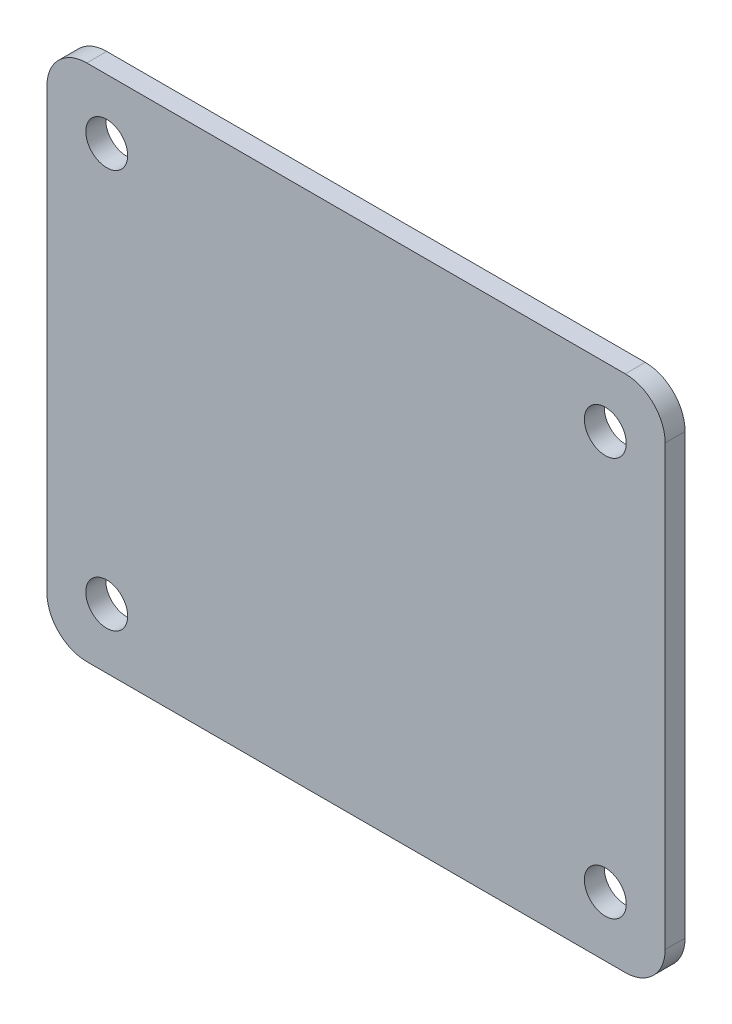
ISO-10303-21;
HEADER;
FILE_DESCRIPTION(('STEP AP214'),'2;1');
FILE_NAME('part.step','',(''),(''),'','','');
FILE_SCHEMA(('AUTOMOTIVE_DESIGN { 1 0 10303 214 1 1 1 1 }'));
ENDSEC;
DATA;
#1=APPLICATION_CONTEXT('core data for automotive mechanical design processes');
#2=APPLICATION_PROTOCOL_DEFINITION('international standard','automotive_design',2000,#1);
#3=PRODUCT_CONTEXT('',#1,'mechanical');
#4=PRODUCT('Part','Part','',(#3));
#5=PRODUCT_RELATED_PRODUCT_CATEGORY('part','',(#4));
#6=PRODUCT_DEFINITION_FORMATION('','',#4);
#7=PRODUCT_DEFINITION_CONTEXT('part definition',#1,'design');
#8=PRODUCT_DEFINITION('design','',#6,#7);
#9=PRODUCT_DEFINITION_SHAPE('','',#8);
#10=(LENGTH_UNIT() NAMED_UNIT(*) SI_UNIT(.MILLI.,.METRE.));
#11=(NAMED_UNIT(*) PLANE_ANGLE_UNIT() SI_UNIT($,.RADIAN.));
#12=(NAMED_UNIT(*) SI_UNIT($,.STERADIAN.) SOLID_ANGLE_UNIT());
#13=UNCERTAINTY_MEASURE_WITH_UNIT(LENGTH_MEASURE(1.E-05),#10,'distance_accuracy_value','');
#14=(GEOMETRIC_REPRESENTATION_CONTEXT(3) GLOBAL_UNCERTAINTY_ASSIGNED_CONTEXT((#13)) GLOBAL_UNIT_ASSIGNED_CONTEXT((#10,
#11,#12)) REPRESENTATION_CONTEXT('',''));
#15=CARTESIAN_POINT('',(0.,0.,0.));
#16=DIRECTION('',(0.,0.,1.));
#17=DIRECTION('',(1.,0.,0.));
#18=AXIS2_PLACEMENT_3D('',#15,#16,#17);
#19=CARTESIAN_POINT('',(-67.5,20.25,50.));
#20=DIRECTION('',(0.,0.,-1.));
#21=DIRECTION('',(-1.,0.,0.));
#22=AXIS2_PLACEMENT_3D('',#19,#20,#21);
#23=PLANE('',#22);
#24=CARTESIAN_POINT('',(-67.5,20.25,50.));
#25=DIRECTION('',(0.,0.,1.));
#26=DIRECTION('',(-1.,0.,0.));
#27=AXIS2_PLACEMENT_3D('',#24,#25,#26);
#28=CIRCLE('',#27,10.);
#29=CARTESIAN_POINT('',(-77.5,20.25,50.));
#30=VERTEX_POINT('',#29);
#31=CARTESIAN_POINT('',(-67.5,10.25,50.));
#32=VERTEX_POINT('',#31);
#33=EDGE_CURVE('E166',#30,#32,#28,.T.);
#34=ORIENTED_EDGE('',*,*,#33,.T.);
#35=DIRECTION('',(1.,0.,0.));
#36=VECTOR('',#35,1.);
#37=CARTESIAN_POINT('',(-67.5,10.25,50.));
#38=LINE('',#37,#36);
#39=CARTESIAN_POINT('',(67.5,10.25,50.));
#40=VERTEX_POINT('',#39);
#41=EDGE_CURVE('E101',#32,#40,#38,.T.);
#42=ORIENTED_EDGE('',*,*,#41,.T.);
#43=CARTESIAN_POINT('',(67.5,20.25,50.));
#44=DIRECTION('',(0.,0.,1.));
#45=DIRECTION('',(1.,0.,0.));
#46=AXIS2_PLACEMENT_3D('',#43,#44,#45);
#47=CIRCLE('',#46,10.);
#48=CARTESIAN_POINT('',(77.5,20.25,50.));
#49=VERTEX_POINT('',#48);
#50=EDGE_CURVE('E189',#40,#49,#47,.T.);
#51=ORIENTED_EDGE('',*,*,#50,.T.);
#52=DIRECTION('',(0.,1.,0.));
#53=VECTOR('',#52,1.);
#54=CARTESIAN_POINT('',(77.5,20.25,50.));
#55=LINE('',#54,#53);
#56=CARTESIAN_POINT('',(77.5,130.25,50.));
#57=VERTEX_POINT('',#56);
#58=EDGE_CURVE('E202',#49,#57,#55,.T.);
#59=ORIENTED_EDGE('',*,*,#58,.T.);
#60=CARTESIAN_POINT('',(67.5,130.25,50.));
#61=DIRECTION('',(0.,0.,1.));
#62=DIRECTION('',(-1.,0.,0.));
#63=AXIS2_PLACEMENT_3D('',#60,#61,#62);
#64=CIRCLE('',#63,9.99999999999999);
#65=CARTESIAN_POINT('',(67.5,140.25,50.));
#66=VERTEX_POINT('',#65);
#67=EDGE_CURVE('E120',#57,#66,#64,.T.);
#68=ORIENTED_EDGE('',*,*,#67,.T.);
#69=DIRECTION('',(-1.,0.,0.));
#70=VECTOR('',#69,1.);
#71=CARTESIAN_POINT('',(-67.5,140.25,50.));
#72=LINE('',#71,#70);
#73=CARTESIAN_POINT('',(-67.5,140.25,50.));
#74=VERTEX_POINT('',#73);
#75=EDGE_CURVE('E114',#66,#74,#72,.T.);
#76=ORIENTED_EDGE('',*,*,#75,.T.);
#77=CARTESIAN_POINT('',(-67.5,130.25,50.));
#78=DIRECTION('',(0.,0.,1.));
#79=DIRECTION('',(-1.,0.,0.));
#80=AXIS2_PLACEMENT_3D('',#77,#78,#79);
#81=CIRCLE('',#80,10.);
#82=CARTESIAN_POINT('',(-77.5,130.25,50.));
#83=VERTEX_POINT('',#82);
#84=EDGE_CURVE('E118',#74,#83,#81,.T.);
#85=ORIENTED_EDGE('',*,*,#84,.T.);
#86=DIRECTION('',(0.,-1.,0.));
#87=VECTOR('',#86,1.);
#88=CARTESIAN_POINT('',(-77.5,20.25,50.));
#89=LINE('',#88,#87);
#90=EDGE_CURVE('E58',#83,#30,#89,.T.);
#91=ORIENTED_EDGE('',*,*,#90,.T.);
#92=EDGE_LOOP('',(#34,#42,#51,#59,#68,#76,#85,#91));
#93=FACE_BOUND('',#92,.T.);
#94=CARTESIAN_POINT('',(62.5,125.25,50.));
#95=DIRECTION('',(0.,0.,1.));
#96=DIRECTION('',(1.,0.,0.));
#97=AXIS2_PLACEMENT_3D('',#94,#95,#96);
#98=CIRCLE('',#97,5.25000000000002);
#99=CARTESIAN_POINT('',(67.75,125.25,50.));
#100=VERTEX_POINT('',#99);
#101=EDGE_CURVE('E148',#100,#100,#98,.T.);
#102=ORIENTED_EDGE('',*,*,#101,.F.);
#103=EDGE_LOOP('',(#102));
#104=FACE_BOUND('',#103,.T.);
#105=CARTESIAN_POINT('',(62.5,25.25,50.));
#106=DIRECTION('',(0.,0.,1.));
#107=DIRECTION('',(1.,0.,0.));
#108=AXIS2_PLACEMENT_3D('',#105,#106,#107);
#109=CIRCLE('',#108,5.24999999999998);
#110=CARTESIAN_POINT('',(67.75,25.25,50.));
#111=VERTEX_POINT('',#110);
#112=EDGE_CURVE('E217',#111,#111,#109,.T.);
#113=ORIENTED_EDGE('',*,*,#112,.F.);
#114=EDGE_LOOP('',(#113));
#115=FACE_BOUND('',#114,.T.);
#116=CARTESIAN_POINT('',(-62.5,25.25,50.));
#117=DIRECTION('',(0.,0.,1.));
#118=DIRECTION('',(1.,0.,0.));
#119=AXIS2_PLACEMENT_3D('',#116,#117,#118);
#120=CIRCLE('',#119,5.25);
#121=CARTESIAN_POINT('',(-57.25,25.25,50.));
#122=VERTEX_POINT('',#121);
#123=EDGE_CURVE('E225',#122,#122,#120,.T.);
#124=ORIENTED_EDGE('',*,*,#123,.F.);
#125=EDGE_LOOP('',(#124));
#126=FACE_BOUND('',#125,.T.);
#127=CARTESIAN_POINT('',(-62.5,125.25,50.));
#128=DIRECTION('',(0.,0.,1.));
#129=DIRECTION('',(1.,0.,0.));
#130=AXIS2_PLACEMENT_3D('',#127,#128,#129);
#131=CIRCLE('',#130,5.25);
#132=CARTESIAN_POINT('',(-57.25,125.25,50.));
#133=VERTEX_POINT('',#132);
#134=EDGE_CURVE('E233',#133,#133,#131,.T.);
#135=ORIENTED_EDGE('',*,*,#134,.F.);
#136=EDGE_LOOP('',(#135));
#137=FACE_BOUND('',#136,.T.);
#138=ADVANCED_FACE('F40',(#93,#104,#115,#126,#137),#23,.F.);
#139=CARTESIAN_POINT('',(-67.5,20.25,45.));
#140=DIRECTION('',(0.,0.,-1.));
#141=DIRECTION('',(-1.,0.,0.));
#142=AXIS2_PLACEMENT_3D('',#139,#140,#141);
#143=PLANE('',#142);
#144=CARTESIAN_POINT('',(-62.5,25.25,45.));
#145=DIRECTION('',(0.,0.,1.));
#146=DIRECTION('',(1.,0.,0.));
#147=AXIS2_PLACEMENT_3D('',#144,#145,#146);
#148=CIRCLE('',#147,5.25);
#149=CARTESIAN_POINT('',(-57.25,25.25,45.));
#150=VERTEX_POINT('',#149);
#151=EDGE_CURVE('E229',#150,#150,#148,.T.);
#152=ORIENTED_EDGE('',*,*,#151,.T.);
#153=EDGE_LOOP('',(#152));
#154=FACE_BOUND('',#153,.T.);
#155=CARTESIAN_POINT('',(62.5,125.25,45.));
#156=DIRECTION('',(0.,0.,1.));
#157=DIRECTION('',(1.,0.,0.));
#158=AXIS2_PLACEMENT_3D('',#155,#156,#157);
#159=CIRCLE('',#158,5.25000000000002);
#160=CARTESIAN_POINT('',(67.75,125.25,45.));
#161=VERTEX_POINT('',#160);
#162=EDGE_CURVE('E213',#161,#161,#159,.T.);
#163=ORIENTED_EDGE('',*,*,#162,.T.);
#164=EDGE_LOOP('',(#163));
#165=FACE_BOUND('',#164,.T.);
#166=CARTESIAN_POINT('',(-67.5,20.25,45.));
#167=DIRECTION('',(0.,0.,1.));
#168=DIRECTION('',(-1.,0.,0.));
#169=AXIS2_PLACEMENT_3D('',#166,#167,#168);
#170=CIRCLE('',#169,10.);
#171=CARTESIAN_POINT('',(-77.5,20.25,45.));
#172=VERTEX_POINT('',#171);
#173=CARTESIAN_POINT('',(-67.5,10.25,45.));
#174=VERTEX_POINT('',#173);
#175=EDGE_CURVE('E143',#172,#174,#170,.T.);
#176=ORIENTED_EDGE('',*,*,#175,.F.);
#177=DIRECTION('',(0.,-1.,0.));
#178=VECTOR('',#177,1.);
#179=CARTESIAN_POINT('',(-77.5,20.25,45.));
#180=LINE('',#179,#178);
#181=CARTESIAN_POINT('',(-77.5,130.25,45.));
#182=VERTEX_POINT('',#181);
#183=EDGE_CURVE('E93',#182,#172,#180,.T.);
#184=ORIENTED_EDGE('',*,*,#183,.F.);
#185=CARTESIAN_POINT('',(-67.5,130.25,45.));
#186=DIRECTION('',(0.,0.,1.));
#187=DIRECTION('',(-1.,0.,0.));
#188=AXIS2_PLACEMENT_3D('',#185,#186,#187);
#189=CIRCLE('',#188,10.);
#190=CARTESIAN_POINT('',(-67.5,140.25,45.));
#191=VERTEX_POINT('',#190);
#192=EDGE_CURVE('E87',#191,#182,#189,.T.);
#193=ORIENTED_EDGE('',*,*,#192,.F.);
#194=DIRECTION('',(-1.,0.,0.));
#195=VECTOR('',#194,1.);
#196=CARTESIAN_POINT('',(-67.5,140.25,45.));
#197=LINE('',#196,#195);
#198=CARTESIAN_POINT('',(67.5,140.25,45.));
#199=VERTEX_POINT('',#198);
#200=EDGE_CURVE('E129',#199,#191,#197,.T.);
#201=ORIENTED_EDGE('',*,*,#200,.F.);
#202=CARTESIAN_POINT('',(67.5,130.25,45.));
#203=DIRECTION('',(0.,0.,1.));
#204=DIRECTION('',(-1.,0.,0.));
#205=AXIS2_PLACEMENT_3D('',#202,#203,#204);
#206=CIRCLE('',#205,9.99999999999999);
#207=CARTESIAN_POINT('',(77.5,130.25,45.));
#208=VERTEX_POINT('',#207);
#209=EDGE_CURVE('E157',#208,#199,#206,.T.);
#210=ORIENTED_EDGE('',*,*,#209,.F.);
#211=DIRECTION('',(0.,1.,0.));
#212=VECTOR('',#211,1.);
#213=CARTESIAN_POINT('',(77.5,20.25,45.));
#214=LINE('',#213,#212);
#215=CARTESIAN_POINT('',(77.5,20.25,45.));
#216=VERTEX_POINT('',#215);
#217=EDGE_CURVE('E154',#216,#208,#214,.T.);
#218=ORIENTED_EDGE('',*,*,#217,.F.);
#219=CARTESIAN_POINT('',(67.5,20.25,45.));
#220=DIRECTION('',(0.,0.,1.));
#221=DIRECTION('',(1.,0.,0.));
#222=AXIS2_PLACEMENT_3D('',#219,#220,#221);
#223=CIRCLE('',#222,10.);
#224=CARTESIAN_POINT('',(67.5,10.25,45.));
#225=VERTEX_POINT('',#224);
#226=EDGE_CURVE('E151',#225,#216,#223,.T.);
#227=ORIENTED_EDGE('',*,*,#226,.F.);
#228=DIRECTION('',(1.,0.,0.));
#229=VECTOR('',#228,1.);
#230=CARTESIAN_POINT('',(-67.5,10.25,45.));
#231=LINE('',#230,#229);
#232=EDGE_CURVE('E147',#174,#225,#231,.T.);
#233=ORIENTED_EDGE('',*,*,#232,.F.);
#234=EDGE_LOOP('',(#176,#184,#193,#201,#210,#218,#227,#233));
#235=FACE_BOUND('',#234,.T.);
#236=CARTESIAN_POINT('',(62.5,25.25,45.));
#237=DIRECTION('',(0.,0.,1.));
#238=DIRECTION('',(1.,0.,0.));
#239=AXIS2_PLACEMENT_3D('',#236,#237,#238);
#240=CIRCLE('',#239,5.24999999999998);
#241=CARTESIAN_POINT('',(67.75,25.25,45.));
#242=VERTEX_POINT('',#241);
#243=EDGE_CURVE('E221',#242,#242,#240,.T.);
#244=ORIENTED_EDGE('',*,*,#243,.T.);
#245=EDGE_LOOP('',(#244));
#246=FACE_BOUND('',#245,.T.);
#247=CARTESIAN_POINT('',(-62.5,125.25,45.));
#248=DIRECTION('',(0.,0.,1.));
#249=DIRECTION('',(1.,0.,0.));
#250=AXIS2_PLACEMENT_3D('',#247,#248,#249);
#251=CIRCLE('',#250,5.25);
#252=CARTESIAN_POINT('',(-57.25,125.25,45.));
#253=VERTEX_POINT('',#252);
#254=EDGE_CURVE('E237',#253,#253,#251,.T.);
#255=ORIENTED_EDGE('',*,*,#254,.T.);
#256=EDGE_LOOP('',(#255));
#257=FACE_BOUND('',#256,.T.);
#258=ADVANCED_FACE('F193',(#154,#165,#235,#246,#257),#143,.T.);
#259=CARTESIAN_POINT('',(-67.5,20.25,50.));
#260=DIRECTION('',(0.,0.,-1.));
#261=DIRECTION('',(-1.,0.,0.));
#262=AXIS2_PLACEMENT_3D('',#259,#260,#261);
#263=CYLINDRICAL_SURFACE('',#262,10.);
#264=ORIENTED_EDGE('',*,*,#175,.T.);
#265=DIRECTION('',(0.,0.,-1.));
#266=VECTOR('',#265,1.);
#267=CARTESIAN_POINT('',(-67.5,10.25,50.));
#268=LINE('',#267,#266);
#269=EDGE_CURVE('E11',#32,#174,#268,.T.);
#270=ORIENTED_EDGE('',*,*,#269,.F.);
#271=ORIENTED_EDGE('',*,*,#33,.F.);
#272=DIRECTION('',(0.,0.,-1.));
#273=VECTOR('',#272,1.);
#274=CARTESIAN_POINT('',(-77.5,20.25,50.));
#275=LINE('',#274,#273);
#276=EDGE_CURVE('E139',#30,#172,#275,.T.);
#277=ORIENTED_EDGE('',*,*,#276,.T.);
#278=EDGE_LOOP('',(#264,#270,#271,#277));
#279=FACE_BOUND('',#278,.T.);
#280=ADVANCED_FACE('F42',(#279),#263,.T.);
#281=CARTESIAN_POINT('',(-67.5,10.25,50.));
#282=DIRECTION('',(0.,1.,0.));
#283=DIRECTION('',(0.,0.,1.));
#284=AXIS2_PLACEMENT_3D('',#281,#282,#283);
#285=PLANE('',#284);
#286=ORIENTED_EDGE('',*,*,#232,.T.);
#287=DIRECTION('',(0.,0.,-1.));
#288=VECTOR('',#287,1.);
#289=CARTESIAN_POINT('',(67.5,10.25,50.));
#290=LINE('',#289,#288);
#291=EDGE_CURVE('E50',#40,#225,#290,.T.);
#292=ORIENTED_EDGE('',*,*,#291,.F.);
#293=ORIENTED_EDGE('',*,*,#41,.F.);
#294=ORIENTED_EDGE('',*,*,#269,.T.);
#295=EDGE_LOOP('',(#286,#292,#293,#294));
#296=FACE_BOUND('',#295,.T.);
#297=ADVANCED_FACE('F272',(#296),#285,.F.);
#298=CARTESIAN_POINT('',(67.5,20.25,50.));
#299=DIRECTION('',(0.,0.,-1.));
#300=DIRECTION('',(-1.,0.,0.));
#301=AXIS2_PLACEMENT_3D('',#298,#299,#300);
#302=CYLINDRICAL_SURFACE('',#301,10.);
#303=ORIENTED_EDGE('',*,*,#226,.T.);
#304=DIRECTION('',(0.,0.,-1.));
#305=VECTOR('',#304,1.);
#306=CARTESIAN_POINT('',(77.5,20.25,50.));
#307=LINE('',#306,#305);
#308=EDGE_CURVE('E177',#49,#216,#307,.T.);
#309=ORIENTED_EDGE('',*,*,#308,.F.);
#310=ORIENTED_EDGE('',*,*,#50,.F.);
#311=ORIENTED_EDGE('',*,*,#291,.T.);
#312=EDGE_LOOP('',(#303,#309,#310,#311));
#313=FACE_BOUND('',#312,.T.);
#314=ADVANCED_FACE('F187',(#313),#302,.T.);
#315=CARTESIAN_POINT('',(77.5,20.25,50.));
#316=DIRECTION('',(-1.,0.,0.));
#317=DIRECTION('',(0.,-1.,0.));
#318=AXIS2_PLACEMENT_3D('',#315,#316,#317);
#319=PLANE('',#318);
#320=ORIENTED_EDGE('',*,*,#217,.T.);
#321=DIRECTION('',(0.,0.,-1.));
#322=VECTOR('',#321,1.);
#323=CARTESIAN_POINT('',(77.5,130.25,50.));
#324=LINE('',#323,#322);
#325=EDGE_CURVE('E173',#57,#208,#324,.T.);
#326=ORIENTED_EDGE('',*,*,#325,.F.);
#327=ORIENTED_EDGE('',*,*,#58,.F.);
#328=ORIENTED_EDGE('',*,*,#308,.T.);
#329=EDGE_LOOP('',(#320,#326,#327,#328));
#330=FACE_BOUND('',#329,.T.);
#331=ADVANCED_FACE('F198',(#330),#319,.F.);
#332=CARTESIAN_POINT('',(67.5,130.25,50.));
#333=DIRECTION('',(0.,0.,-1.));
#334=DIRECTION('',(-1.,0.,0.));
#335=AXIS2_PLACEMENT_3D('',#332,#333,#334);
#336=CYLINDRICAL_SURFACE('',#335,9.99999999999999);
#337=ORIENTED_EDGE('',*,*,#209,.T.);
#338=DIRECTION('',(0.,0.,-1.));
#339=VECTOR('',#338,1.);
#340=CARTESIAN_POINT('',(67.5,140.25,50.));
#341=LINE('',#340,#339);
#342=EDGE_CURVE('E131',#66,#199,#341,.T.);
#343=ORIENTED_EDGE('',*,*,#342,.F.);
#344=ORIENTED_EDGE('',*,*,#67,.F.);
#345=ORIENTED_EDGE('',*,*,#325,.T.);
#346=EDGE_LOOP('',(#337,#343,#344,#345));
#347=FACE_BOUND('',#346,.T.);
#348=ADVANCED_FACE('F201',(#347),#336,.T.);
#349=CARTESIAN_POINT('',(-67.5,140.25,50.));
#350=DIRECTION('',(0.,-1.,0.));
#351=DIRECTION('',(0.,0.,-1.));
#352=AXIS2_PLACEMENT_3D('',#349,#350,#351);
#353=PLANE('',#352);
#354=ORIENTED_EDGE('',*,*,#200,.T.);
#355=DIRECTION('',(0.,0.,-1.));
#356=VECTOR('',#355,1.);
#357=CARTESIAN_POINT('',(-67.5,140.25,50.));
#358=LINE('',#357,#356);
#359=EDGE_CURVE('E126',#74,#191,#358,.T.);
#360=ORIENTED_EDGE('',*,*,#359,.F.);
#361=ORIENTED_EDGE('',*,*,#75,.F.);
#362=ORIENTED_EDGE('',*,*,#342,.T.);
#363=EDGE_LOOP('',(#354,#360,#361,#362));
#364=FACE_BOUND('',#363,.T.);
#365=ADVANCED_FACE('F127',(#364),#353,.F.);
#366=CARTESIAN_POINT('',(-67.5,130.25,50.));
#367=DIRECTION('',(0.,0.,-1.));
#368=DIRECTION('',(-1.,0.,0.));
#369=AXIS2_PLACEMENT_3D('',#366,#367,#368);
#370=CYLINDRICAL_SURFACE('',#369,10.);
#371=ORIENTED_EDGE('',*,*,#192,.T.);
#372=DIRECTION('',(0.,0.,-1.));
#373=VECTOR('',#372,1.);
#374=CARTESIAN_POINT('',(-77.5,130.25,50.));
#375=LINE('',#374,#373);
#376=EDGE_CURVE('E132',#83,#182,#375,.T.);
#377=ORIENTED_EDGE('',*,*,#376,.F.);
#378=ORIENTED_EDGE('',*,*,#84,.F.);
#379=ORIENTED_EDGE('',*,*,#359,.T.);
#380=EDGE_LOOP('',(#371,#377,#378,#379));
#381=FACE_BOUND('',#380,.T.);
#382=ADVANCED_FACE('F134',(#381),#370,.T.);
#383=CARTESIAN_POINT('',(-77.5,20.25,50.));
#384=DIRECTION('',(1.,0.,0.));
#385=DIRECTION('',(0.,0.,-1.));
#386=AXIS2_PLACEMENT_3D('',#383,#384,#385);
#387=PLANE('',#386);
#388=ORIENTED_EDGE('',*,*,#183,.T.);
#389=ORIENTED_EDGE('',*,*,#276,.F.);
#390=ORIENTED_EDGE('',*,*,#90,.F.);
#391=ORIENTED_EDGE('',*,*,#376,.T.);
#392=EDGE_LOOP('',(#388,#389,#390,#391));
#393=FACE_BOUND('',#392,.T.);
#394=ADVANCED_FACE('F260',(#393),#387,.F.);
#395=CARTESIAN_POINT('',(62.5,125.25,50.));
#396=DIRECTION('',(0.,0.,-1.));
#397=DIRECTION('',(-1.,0.,0.));
#398=AXIS2_PLACEMENT_3D('',#395,#396,#397);
#399=CYLINDRICAL_SURFACE('',#398,5.25000000000002);
#400=ORIENTED_EDGE('',*,*,#101,.T.);
#401=EDGE_LOOP('',(#400));
#402=FACE_BOUND('',#401,.T.);
#403=ORIENTED_EDGE('',*,*,#162,.F.);
#404=EDGE_LOOP('',(#403));
#405=FACE_BOUND('',#404,.T.);
#406=ADVANCED_FACE('F257',(#402,#405),#399,.F.);
#407=CARTESIAN_POINT('',(62.5,25.25,50.));
#408=DIRECTION('',(0.,0.,-1.));
#409=DIRECTION('',(-1.,0.,0.));
#410=AXIS2_PLACEMENT_3D('',#407,#408,#409);
#411=CYLINDRICAL_SURFACE('',#410,5.24999999999998);
#412=ORIENTED_EDGE('',*,*,#112,.T.);
#413=EDGE_LOOP('',(#412));
#414=FACE_BOUND('',#413,.T.);
#415=ORIENTED_EDGE('',*,*,#243,.F.);
#416=EDGE_LOOP('',(#415));
#417=FACE_BOUND('',#416,.T.);
#418=ADVANCED_FACE('F362',(#414,#417),#411,.F.);
#419=CARTESIAN_POINT('',(-62.5,25.25,50.));
#420=DIRECTION('',(0.,0.,-1.));
#421=DIRECTION('',(-1.,0.,0.));
#422=AXIS2_PLACEMENT_3D('',#419,#420,#421);
#423=CYLINDRICAL_SURFACE('',#422,5.25);
#424=ORIENTED_EDGE('',*,*,#123,.T.);
#425=EDGE_LOOP('',(#424));
#426=FACE_BOUND('',#425,.T.);
#427=ORIENTED_EDGE('',*,*,#151,.F.);
#428=EDGE_LOOP('',(#427));
#429=FACE_BOUND('',#428,.T.);
#430=ADVANCED_FACE('F372',(#426,#429),#423,.F.);
#431=CARTESIAN_POINT('',(-62.5,125.25,50.));
#432=DIRECTION('',(0.,0.,-1.));
#433=DIRECTION('',(-1.,0.,0.));
#434=AXIS2_PLACEMENT_3D('',#431,#432,#433);
#435=CYLINDRICAL_SURFACE('',#434,5.25);
#436=ORIENTED_EDGE('',*,*,#134,.T.);
#437=EDGE_LOOP('',(#436));
#438=FACE_BOUND('',#437,.T.);
#439=ORIENTED_EDGE('',*,*,#254,.F.);
#440=EDGE_LOOP('',(#439));
#441=FACE_BOUND('',#440,.T.);
#442=ADVANCED_FACE('F246',(#438,#441),#435,.F.);
#443=CLOSED_SHELL('',(#138,#258,#280,#297,#314,#331,#348,#365,#382,#394,#406,#418,#430,#442));
#444=MANIFOLD_SOLID_BREP('B2',#443);
#445=ADVANCED_BREP_SHAPE_REPRESENTATION('',(#18,#444),#14);
#446=SHAPE_DEFINITION_REPRESENTATION(#9,#445);
ENDSEC;
END-ISO-10303-21;
